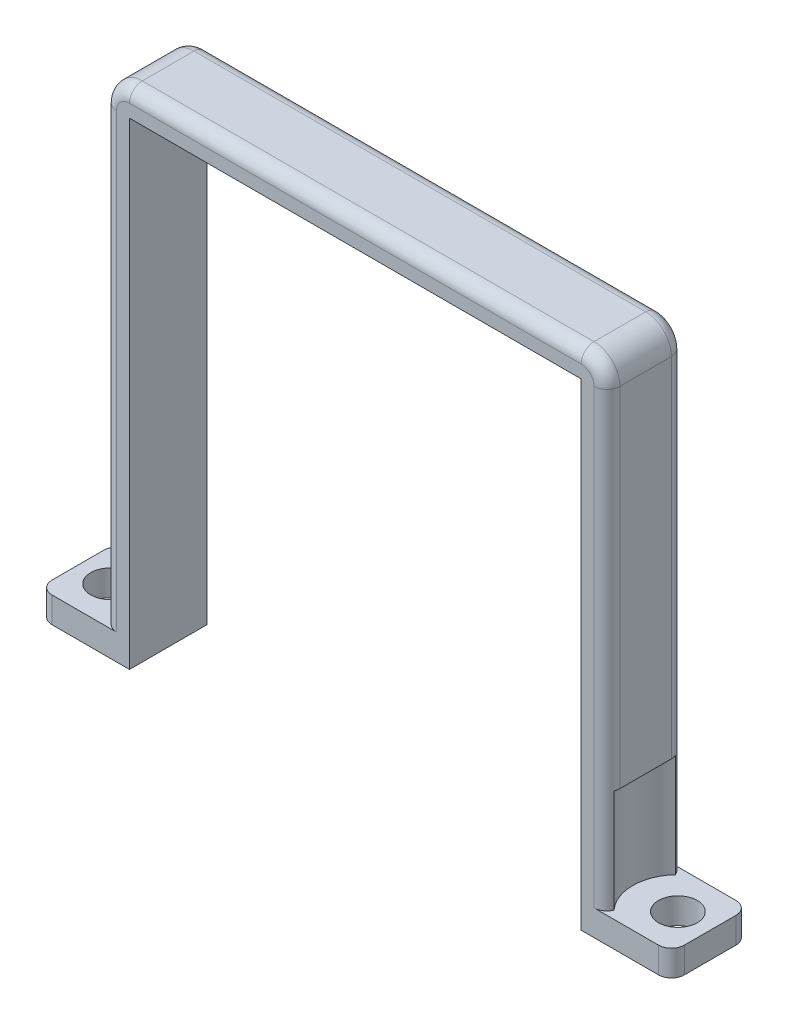
ISO-10303-21;
HEADER;
FILE_DESCRIPTION(('STEP AP214'),'2;1');
FILE_NAME('part.step','',(''),(''),'','','');
FILE_SCHEMA(('AUTOMOTIVE_DESIGN { 1 0 10303 214 1 1 1 1 }'));
ENDSEC;
DATA;
#1=APPLICATION_CONTEXT('core data for automotive mechanical design processes');
#2=APPLICATION_PROTOCOL_DEFINITION('international standard','automotive_design',2000,#1);
#3=PRODUCT_CONTEXT('',#1,'mechanical');
#4=PRODUCT('Part','Part','',(#3));
#5=PRODUCT_RELATED_PRODUCT_CATEGORY('part','',(#4));
#6=PRODUCT_DEFINITION_FORMATION('','',#4);
#7=PRODUCT_DEFINITION_CONTEXT('part definition',#1,'design');
#8=PRODUCT_DEFINITION('design','',#6,#7);
#9=PRODUCT_DEFINITION_SHAPE('','',#8);
#10=(LENGTH_UNIT() NAMED_UNIT(*) SI_UNIT(.MILLI.,.METRE.));
#11=(NAMED_UNIT(*) PLANE_ANGLE_UNIT() SI_UNIT($,.RADIAN.));
#12=(NAMED_UNIT(*) SI_UNIT($,.STERADIAN.) SOLID_ANGLE_UNIT());
#13=UNCERTAINTY_MEASURE_WITH_UNIT(LENGTH_MEASURE(1.E-05),#10,'distance_accuracy_value','');
#14=(GEOMETRIC_REPRESENTATION_CONTEXT(3) GLOBAL_UNCERTAINTY_ASSIGNED_CONTEXT((#13)) GLOBAL_UNIT_ASSIGNED_CONTEXT((#10,
#11,#12)) REPRESENTATION_CONTEXT('',''));
#15=CARTESIAN_POINT('',(0.,0.,0.));
#16=DIRECTION('',(0.,0.,1.));
#17=DIRECTION('',(1.,0.,0.));
#18=AXIS2_PLACEMENT_3D('',#15,#16,#17);
#19=CARTESIAN_POINT('',(19.5,0.,6.));
#20=DIRECTION('',(1.,0.,0.));
#21=DIRECTION('',(0.,1.,0.));
#22=AXIS2_PLACEMENT_3D('',#19,#20,#21);
#23=PLANE('',#22);
#24=DIRECTION('',(0.,0.,-1.));
#25=VECTOR('',#24,1.);
#26=CARTESIAN_POINT('',(19.5,10.,6.));
#27=LINE('',#26,#25);
#28=CARTESIAN_POINT('',(19.5,10.,5.));
#29=VERTEX_POINT('',#28);
#30=CARTESIAN_POINT('',(19.5,10.,1.));
#31=VERTEX_POINT('',#30);
#32=EDGE_CURVE('E350',#29,#31,#27,.T.);
#33=ORIENTED_EDGE('',*,*,#32,.T.);
#34=DIRECTION('',(0.,-1.,0.));
#35=VECTOR('',#34,1.);
#36=CARTESIAN_POINT('',(19.5,37.,1.));
#37=LINE('',#36,#35);
#38=CARTESIAN_POINT('',(19.5,37.,1.));
#39=VERTEX_POINT('',#38);
#40=EDGE_CURVE('E393',#31,#39,#37,.F.);
#41=ORIENTED_EDGE('',*,*,#40,.T.);
#42=DIRECTION('',(0.,0.,-1.));
#43=VECTOR('',#42,1.);
#44=CARTESIAN_POINT('',(19.5,37.,6.));
#45=LINE('',#44,#43);
#46=CARTESIAN_POINT('',(19.5,37.,5.));
#47=VERTEX_POINT('',#46);
#48=EDGE_CURVE('E342',#39,#47,#45,.F.);
#49=ORIENTED_EDGE('',*,*,#48,.T.);
#50=DIRECTION('',(0.,-1.,0.));
#51=VECTOR('',#50,1.);
#52=CARTESIAN_POINT('',(19.5,0.,5.));
#53=LINE('',#52,#51);
#54=EDGE_CURVE('E389',#47,#29,#53,.T.);
#55=ORIENTED_EDGE('',*,*,#54,.T.);
#56=EDGE_LOOP('',(#33,#41,#49,#55));
#57=FACE_BOUND('',#56,.T.);
#58=ADVANCED_FACE('F49',(#57),#23,.T.);
#59=CARTESIAN_POINT('',(-19.5,0.,6.));
#60=DIRECTION('',(1.,0.,0.));
#61=DIRECTION('',(0.,1.,0.));
#62=AXIS2_PLACEMENT_3D('',#59,#60,#61);
#63=PLANE('',#62);
#64=DIRECTION('',(0.,0.,-1.));
#65=VECTOR('',#64,1.);
#66=CARTESIAN_POINT('',(-19.5,37.,6.));
#67=LINE('',#66,#65);
#68=CARTESIAN_POINT('',(-19.5,37.,5.));
#69=VERTEX_POINT('',#68);
#70=CARTESIAN_POINT('',(-19.5,37.,1.));
#71=VERTEX_POINT('',#70);
#72=EDGE_CURVE('E330',#69,#71,#67,.T.);
#73=ORIENTED_EDGE('',*,*,#72,.T.);
#74=DIRECTION('',(0.,-1.,0.));
#75=VECTOR('',#74,1.);
#76=CARTESIAN_POINT('',(-19.5,0.,1.));
#77=LINE('',#76,#75);
#78=CARTESIAN_POINT('',(-19.5,10.,1.));
#79=VERTEX_POINT('',#78);
#80=EDGE_CURVE('E438',#71,#79,#77,.T.);
#81=ORIENTED_EDGE('',*,*,#80,.T.);
#82=DIRECTION('',(0.,0.,1.));
#83=VECTOR('',#82,1.);
#84=CARTESIAN_POINT('',(-19.5,10.,6.));
#85=LINE('',#84,#83);
#86=CARTESIAN_POINT('',(-19.5,10.,5.));
#87=VERTEX_POINT('',#86);
#88=EDGE_CURVE('E346',#79,#87,#85,.T.);
#89=ORIENTED_EDGE('',*,*,#88,.T.);
#90=DIRECTION('',(0.,-1.,0.));
#91=VECTOR('',#90,1.);
#92=CARTESIAN_POINT('',(-19.5,37.,5.));
#93=LINE('',#92,#91);
#94=EDGE_CURVE('E435',#87,#69,#93,.F.);
#95=ORIENTED_EDGE('',*,*,#94,.T.);
#96=EDGE_LOOP('',(#73,#81,#89,#95));
#97=FACE_BOUND('',#96,.T.);
#98=ADVANCED_FACE('F589',(#97),#63,.F.);
#99=CARTESIAN_POINT('',(0.,2.,6.));
#100=DIRECTION('',(0.,-1.,0.));
#101=DIRECTION('',(1.,0.,0.));
#102=AXIS2_PLACEMENT_3D('',#99,#100,#101);
#103=PLANE('',#102);
#104=DIRECTION('',(-1.,0.,0.));
#105=VECTOR('',#104,1.);
#106=CARTESIAN_POINT('',(0.,2.,0.));
#107=LINE('',#106,#105);
#108=CARTESIAN_POINT('',(-18.5,2.,0.));
#109=VERTEX_POINT('',#108);
#110=CARTESIAN_POINT('',(-23.5,2.,0.));
#111=VERTEX_POINT('',#110);
#112=EDGE_CURVE('E285',#109,#111,#107,.T.);
#113=ORIENTED_EDGE('',*,*,#112,.T.);
#114=CARTESIAN_POINT('',(-23.5,2.,1.));
#115=DIRECTION('',(0.,-1.,0.));
#116=DIRECTION('',(1.,0.,0.));
#117=AXIS2_PLACEMENT_3D('',#114,#115,#116);
#118=CIRCLE('',#117,1.);
#119=CARTESIAN_POINT('',(-24.5,2.,1.));
#120=VERTEX_POINT('',#119);
#121=EDGE_CURVE('E67',#111,#120,#118,.F.);
#122=ORIENTED_EDGE('',*,*,#121,.T.);
#123=DIRECTION('',(0.,0.,-1.));
#124=VECTOR('',#123,1.);
#125=CARTESIAN_POINT('',(-24.5,2.,6.));
#126=LINE('',#125,#124);
#127=CARTESIAN_POINT('',(-24.5,2.,5.));
#128=VERTEX_POINT('',#127);
#129=EDGE_CURVE('E327',#128,#120,#126,.T.);
#130=ORIENTED_EDGE('',*,*,#129,.F.);
#131=CARTESIAN_POINT('',(-23.5,2.,5.));
#132=DIRECTION('',(0.,-1.,0.));
#133=DIRECTION('',(1.,0.,0.));
#134=AXIS2_PLACEMENT_3D('',#131,#132,#133);
#135=CIRCLE('',#134,1.);
#136=CARTESIAN_POINT('',(-23.5,2.,6.));
#137=VERTEX_POINT('',#136);
#138=EDGE_CURVE('E484',#128,#137,#135,.F.);
#139=ORIENTED_EDGE('',*,*,#138,.T.);
#140=DIRECTION('',(-1.,0.,0.));
#141=VECTOR('',#140,1.);
#142=CARTESIAN_POINT('',(0.,2.,6.));
#143=LINE('',#142,#141);
#144=CARTESIAN_POINT('',(-18.5,2.,6.));
#145=VERTEX_POINT('',#144);
#146=EDGE_CURVE('E249',#145,#137,#143,.T.);
#147=ORIENTED_EDGE('',*,*,#146,.F.);
#148=CARTESIAN_POINT('',(-18.5,2.,5.));
#149=DIRECTION('',(0.,-1.,0.));
#150=DIRECTION('',(1.,0.,0.));
#151=AXIS2_PLACEMENT_3D('',#148,#149,#150);
#152=CIRCLE('',#151,1.);
#153=CARTESIAN_POINT('',(-19.42766494279,2.00000000000001,5.37341364988242));
#154=VERTEX_POINT('',#153);
#155=EDGE_CURVE('E11',#145,#154,#152,.T.);
#156=ORIENTED_EDGE('',*,*,#155,.T.);
#157=CARTESIAN_POINT('',(-22.,2.00000000000001,3.));
#158=DIRECTION('',(0.,1.,0.));
#159=DIRECTION('',(-1.,0.,0.));
#160=AXIS2_PLACEMENT_3D('',#157,#158,#159);
#161=CIRCLE('',#160,3.5);
#162=CARTESIAN_POINT('',(-19.4276649427899,2.00000000000001,0.626586350117578));
#163=VERTEX_POINT('',#162);
#164=EDGE_CURVE('E608',#154,#163,#161,.T.);
#165=ORIENTED_EDGE('',*,*,#164,.T.);
#166=CARTESIAN_POINT('',(-18.5,2.,1.));
#167=DIRECTION('',(0.,-1.,0.));
#168=DIRECTION('',(1.,0.,0.));
#169=AXIS2_PLACEMENT_3D('',#166,#167,#168);
#170=CIRCLE('',#169,1.);
#171=EDGE_CURVE('E59',#163,#109,#170,.T.);
#172=ORIENTED_EDGE('',*,*,#171,.T.);
#173=EDGE_LOOP('',(#113,#122,#130,#139,#147,#156,#165,#172));
#174=FACE_BOUND('',#173,.T.);
#175=CARTESIAN_POINT('',(-22.,2.00000000000001,3.));
#176=DIRECTION('',(0.,1.,0.));
#177=DIRECTION('',(-1.,0.,0.));
#178=AXIS2_PLACEMENT_3D('',#175,#176,#177);
#179=CIRCLE('',#178,1.5);
#180=CARTESIAN_POINT('',(-23.5,2.00000000000001,3.));
#181=VERTEX_POINT('',#180);
#182=EDGE_CURVE('E624',#181,#181,#179,.T.);
#183=ORIENTED_EDGE('',*,*,#182,.F.);
#184=EDGE_LOOP('',(#183));
#185=FACE_BOUND('',#184,.T.);
#186=ADVANCED_FACE('F658',(#174,#185),#103,.F.);
#187=CARTESIAN_POINT('',(-24.5,0.,6.));
#188=DIRECTION('',(1.,0.,0.));
#189=DIRECTION('',(0.,0.,-1.));
#190=AXIS2_PLACEMENT_3D('',#187,#188,#189);
#191=PLANE('',#190);
#192=ORIENTED_EDGE('',*,*,#129,.T.);
#193=DIRECTION('',(0.,-1.,0.));
#194=VECTOR('',#193,1.);
#195=CARTESIAN_POINT('',(-24.5,0.,1.));
#196=LINE('',#195,#194);
#197=CARTESIAN_POINT('',(-24.5,0.,1.));
#198=VERTEX_POINT('',#197);
#199=EDGE_CURVE('E474',#120,#198,#196,.T.);
#200=ORIENTED_EDGE('',*,*,#199,.T.);
#201=DIRECTION('',(0.,0.,-1.));
#202=VECTOR('',#201,1.);
#203=CARTESIAN_POINT('',(-24.5,0.,6.));
#204=LINE('',#203,#202);
#205=CARTESIAN_POINT('',(-24.5,0.,5.));
#206=VERTEX_POINT('',#205);
#207=EDGE_CURVE('E260',#206,#198,#204,.T.);
#208=ORIENTED_EDGE('',*,*,#207,.F.);
#209=DIRECTION('',(0.,-1.,0.));
#210=VECTOR('',#209,1.);
#211=CARTESIAN_POINT('',(-24.5,2.,5.));
#212=LINE('',#211,#210);
#213=EDGE_CURVE('E74',#206,#128,#212,.F.);
#214=ORIENTED_EDGE('',*,*,#213,.T.);
#215=EDGE_LOOP('',(#192,#200,#208,#214));
#216=FACE_BOUND('',#215,.T.);
#217=ADVANCED_FACE('F731',(#216),#191,.F.);
#218=CARTESIAN_POINT('',(0.,0.,6.));
#219=DIRECTION('',(0.,1.,0.));
#220=DIRECTION('',(-1.,0.,0.));
#221=AXIS2_PLACEMENT_3D('',#218,#219,#220);
#222=PLANE('',#221);
#223=CARTESIAN_POINT('',(-22.,0.,3.));
#224=DIRECTION('',(0.,-1.,0.));
#225=DIRECTION('',(1.,0.,0.));
#226=AXIS2_PLACEMENT_3D('',#223,#224,#225);
#227=CIRCLE('',#226,1.5);
#228=CARTESIAN_POINT('',(-20.5,0.,3.));
#229=VERTEX_POINT('',#228);
#230=EDGE_CURVE('E288',#229,#229,#227,.F.);
#231=ORIENTED_EDGE('',*,*,#230,.T.);
#232=EDGE_LOOP('',(#231));
#233=FACE_BOUND('',#232,.T.);
#234=ORIENTED_EDGE('',*,*,#207,.T.);
#235=CARTESIAN_POINT('',(-23.5,0.,1.));
#236=DIRECTION('',(0.,1.,0.));
#237=DIRECTION('',(-1.,0.,0.));
#238=AXIS2_PLACEMENT_3D('',#235,#236,#237);
#239=CIRCLE('',#238,1.);
#240=CARTESIAN_POINT('',(-23.5,0.,0.));
#241=VERTEX_POINT('',#240);
#242=EDGE_CURVE('E481',#198,#241,#239,.F.);
#243=ORIENTED_EDGE('',*,*,#242,.T.);
#244=DIRECTION('',(1.,0.,0.));
#245=VECTOR('',#244,1.);
#246=CARTESIAN_POINT('',(0.,0.,0.));
#247=LINE('',#246,#245);
#248=CARTESIAN_POINT('',(-17.5,0.,0.));
#249=VERTEX_POINT('',#248);
#250=EDGE_CURVE('E256',#241,#249,#247,.T.);
#251=ORIENTED_EDGE('',*,*,#250,.T.);
#252=DIRECTION('',(0.,0.,-1.));
#253=VECTOR('',#252,1.);
#254=CARTESIAN_POINT('',(-17.5,0.,6.));
#255=LINE('',#254,#253);
#256=CARTESIAN_POINT('',(-17.5,0.,6.));
#257=VERTEX_POINT('',#256);
#258=EDGE_CURVE('E252',#257,#249,#255,.T.);
#259=ORIENTED_EDGE('',*,*,#258,.F.);
#260=DIRECTION('',(1.,0.,0.));
#261=VECTOR('',#260,1.);
#262=CARTESIAN_POINT('',(0.,0.,6.));
#263=LINE('',#262,#261);
#264=CARTESIAN_POINT('',(-23.5,0.,6.));
#265=VERTEX_POINT('',#264);
#266=EDGE_CURVE('E238',#265,#257,#263,.T.);
#267=ORIENTED_EDGE('',*,*,#266,.F.);
#268=CARTESIAN_POINT('',(-23.5,0.,5.));
#269=DIRECTION('',(0.,1.,0.));
#270=DIRECTION('',(-1.,0.,0.));
#271=AXIS2_PLACEMENT_3D('',#268,#269,#270);
#272=CIRCLE('',#271,1.);
#273=EDGE_CURVE('E478',#265,#206,#272,.F.);
#274=ORIENTED_EDGE('',*,*,#273,.T.);
#275=EDGE_LOOP('',(#234,#243,#251,#259,#267,#274));
#276=FACE_BOUND('',#275,.T.);
#277=ADVANCED_FACE('F254',(#233,#276),#222,.F.);
#278=CARTESIAN_POINT('',(-17.5,0.,6.));
#279=DIRECTION('',(-1.,0.,0.));
#280=DIRECTION('',(0.,0.,1.));
#281=AXIS2_PLACEMENT_3D('',#278,#279,#280);
#282=PLANE('',#281);
#283=DIRECTION('',(0.,1.,0.));
#284=VECTOR('',#283,1.);
#285=CARTESIAN_POINT('',(-17.5,0.,0.));
#286=LINE('',#285,#284);
#287=CARTESIAN_POINT('',(-17.5,37.,0.));
#288=VERTEX_POINT('',#287);
#289=EDGE_CURVE('E291',#249,#288,#286,.T.);
#290=ORIENTED_EDGE('',*,*,#289,.T.);
#291=DIRECTION('',(0.,0.,-1.));
#292=VECTOR('',#291,1.);
#293=CARTESIAN_POINT('',(-17.5,37.,6.));
#294=LINE('',#293,#292);
#295=CARTESIAN_POINT('',(-17.5,37.,6.));
#296=VERTEX_POINT('',#295);
#297=EDGE_CURVE('E261',#296,#288,#294,.T.);
#298=ORIENTED_EDGE('',*,*,#297,.F.);
#299=DIRECTION('',(0.,1.,0.));
#300=VECTOR('',#299,1.);
#301=CARTESIAN_POINT('',(-17.5,0.,6.));
#302=LINE('',#301,#300);
#303=EDGE_CURVE('E242',#257,#296,#302,.T.);
#304=ORIENTED_EDGE('',*,*,#303,.F.);
#305=ORIENTED_EDGE('',*,*,#258,.T.);
#306=EDGE_LOOP('',(#290,#298,#304,#305));
#307=FACE_BOUND('',#306,.T.);
#308=ADVANCED_FACE('F263',(#307),#282,.F.);
#309=CARTESIAN_POINT('',(0.,37.,6.));
#310=DIRECTION('',(0.,1.,0.));
#311=DIRECTION('',(0.,0.,1.));
#312=AXIS2_PLACEMENT_3D('',#309,#310,#311);
#313=PLANE('',#312);
#314=DIRECTION('',(1.,0.,0.));
#315=VECTOR('',#314,1.);
#316=CARTESIAN_POINT('',(0.,37.,0.));
#317=LINE('',#316,#315);
#318=CARTESIAN_POINT('',(17.5,37.,0.));
#319=VERTEX_POINT('',#318);
#320=EDGE_CURVE('E294',#288,#319,#317,.T.);
#321=ORIENTED_EDGE('',*,*,#320,.T.);
#322=DIRECTION('',(0.,0.,-1.));
#323=VECTOR('',#322,1.);
#324=CARTESIAN_POINT('',(17.5,37.,6.));
#325=LINE('',#324,#323);
#326=CARTESIAN_POINT('',(17.5,37.,6.));
#327=VERTEX_POINT('',#326);
#328=EDGE_CURVE('E320',#327,#319,#325,.T.);
#329=ORIENTED_EDGE('',*,*,#328,.F.);
#330=DIRECTION('',(1.,0.,0.));
#331=VECTOR('',#330,1.);
#332=CARTESIAN_POINT('',(0.,37.,6.));
#333=LINE('',#332,#331);
#334=EDGE_CURVE('E267',#296,#327,#333,.T.);
#335=ORIENTED_EDGE('',*,*,#334,.F.);
#336=ORIENTED_EDGE('',*,*,#297,.T.);
#337=EDGE_LOOP('',(#321,#329,#335,#336));
#338=FACE_BOUND('',#337,.T.);
#339=ADVANCED_FACE('F736',(#338),#313,.F.);
#340=CARTESIAN_POINT('',(17.5,0.,6.));
#341=DIRECTION('',(-1.,0.,0.));
#342=DIRECTION('',(0.,0.,1.));
#343=AXIS2_PLACEMENT_3D('',#340,#341,#342);
#344=PLANE('',#343);
#345=DIRECTION('',(0.,1.,0.));
#346=VECTOR('',#345,1.);
#347=CARTESIAN_POINT('',(17.5,0.,0.));
#348=LINE('',#347,#346);
#349=CARTESIAN_POINT('',(17.5,0.,0.));
#350=VERTEX_POINT('',#349);
#351=EDGE_CURVE('E298',#350,#319,#348,.T.);
#352=ORIENTED_EDGE('',*,*,#351,.F.);
#353=DIRECTION('',(0.,0.,-1.));
#354=VECTOR('',#353,1.);
#355=CARTESIAN_POINT('',(17.5,0.,6.));
#356=LINE('',#355,#354);
#357=CARTESIAN_POINT('',(17.5,0.,6.));
#358=VERTEX_POINT('',#357);
#359=EDGE_CURVE('E316',#358,#350,#356,.T.);
#360=ORIENTED_EDGE('',*,*,#359,.F.);
#361=DIRECTION('',(0.,1.,0.));
#362=VECTOR('',#361,1.);
#363=CARTESIAN_POINT('',(17.5,0.,6.));
#364=LINE('',#363,#362);
#365=EDGE_CURVE('E270',#358,#327,#364,.T.);
#366=ORIENTED_EDGE('',*,*,#365,.T.);
#367=ORIENTED_EDGE('',*,*,#328,.T.);
#368=EDGE_LOOP('',(#352,#360,#366,#367));
#369=FACE_BOUND('',#368,.T.);
#370=ADVANCED_FACE('F744',(#369),#344,.T.);
#371=CARTESIAN_POINT('',(0.,0.,6.));
#372=DIRECTION('',(0.,-1.,0.));
#373=DIRECTION('',(1.,0.,0.));
#374=AXIS2_PLACEMENT_3D('',#371,#372,#373);
#375=PLANE('',#374);
#376=CARTESIAN_POINT('',(22.,0.,2.99999999999999));
#377=DIRECTION('',(0.,-1.,0.));
#378=DIRECTION('',(1.,0.,0.));
#379=AXIS2_PLACEMENT_3D('',#376,#377,#378);
#380=CIRCLE('',#379,1.5);
#381=CARTESIAN_POINT('',(23.5,0.,2.99999999999999));
#382=VERTEX_POINT('',#381);
#383=EDGE_CURVE('E607',#382,#382,#380,.F.);
#384=ORIENTED_EDGE('',*,*,#383,.T.);
#385=EDGE_LOOP('',(#384));
#386=FACE_BOUND('',#385,.T.);
#387=DIRECTION('',(-1.,0.,0.));
#388=VECTOR('',#387,1.);
#389=CARTESIAN_POINT('',(0.,0.,0.));
#390=LINE('',#389,#388);
#391=CARTESIAN_POINT('',(23.5,0.,0.));
#392=VERTEX_POINT('',#391);
#393=EDGE_CURVE('E302',#392,#350,#390,.T.);
#394=ORIENTED_EDGE('',*,*,#393,.F.);
#395=CARTESIAN_POINT('',(23.5,0.,1.));
#396=DIRECTION('',(0.,-1.,0.));
#397=DIRECTION('',(1.,0.,0.));
#398=AXIS2_PLACEMENT_3D('',#395,#396,#397);
#399=CIRCLE('',#398,1.);
#400=CARTESIAN_POINT('',(24.5,0.,1.));
#401=VERTEX_POINT('',#400);
#402=EDGE_CURVE('E456',#392,#401,#399,.T.);
#403=ORIENTED_EDGE('',*,*,#402,.T.);
#404=DIRECTION('',(0.,0.,-1.));
#405=VECTOR('',#404,1.);
#406=CARTESIAN_POINT('',(24.5,0.,6.));
#407=LINE('',#406,#405);
#408=CARTESIAN_POINT('',(24.5,0.,5.));
#409=VERTEX_POINT('',#408);
#410=EDGE_CURVE('E312',#409,#401,#407,.T.);
#411=ORIENTED_EDGE('',*,*,#410,.F.);
#412=CARTESIAN_POINT('',(23.5,0.,5.));
#413=DIRECTION('',(0.,-1.,0.));
#414=DIRECTION('',(1.,0.,0.));
#415=AXIS2_PLACEMENT_3D('',#412,#413,#414);
#416=CIRCLE('',#415,1.);
#417=CARTESIAN_POINT('',(23.5,0.,6.));
#418=VERTEX_POINT('',#417);
#419=EDGE_CURVE('E453',#409,#418,#416,.T.);
#420=ORIENTED_EDGE('',*,*,#419,.T.);
#421=DIRECTION('',(-1.,0.,0.));
#422=VECTOR('',#421,1.);
#423=CARTESIAN_POINT('',(0.,0.,6.));
#424=LINE('',#423,#422);
#425=EDGE_CURVE('E277',#418,#358,#424,.T.);
#426=ORIENTED_EDGE('',*,*,#425,.T.);
#427=ORIENTED_EDGE('',*,*,#359,.T.);
#428=EDGE_LOOP('',(#394,#403,#411,#420,#426,#427));
#429=FACE_BOUND('',#428,.T.);
#430=ADVANCED_FACE('F649',(#386,#429),#375,.T.);
#431=CARTESIAN_POINT('',(24.5,0.,6.));
#432=DIRECTION('',(1.,0.,0.));
#433=DIRECTION('',(0.,0.,-1.));
#434=AXIS2_PLACEMENT_3D('',#431,#432,#433);
#435=PLANE('',#434);
#436=ORIENTED_EDGE('',*,*,#410,.T.);
#437=DIRECTION('',(0.,-1.,0.));
#438=VECTOR('',#437,1.);
#439=CARTESIAN_POINT('',(24.5,2.,1.));
#440=LINE('',#439,#438);
#441=CARTESIAN_POINT('',(24.5,2.,1.));
#442=VERTEX_POINT('',#441);
#443=EDGE_CURVE('E463',#401,#442,#440,.F.);
#444=ORIENTED_EDGE('',*,*,#443,.T.);
#445=DIRECTION('',(0.,0.,-1.));
#446=VECTOR('',#445,1.);
#447=CARTESIAN_POINT('',(24.5,2.,6.));
#448=LINE('',#447,#446);
#449=CARTESIAN_POINT('',(24.5,2.,5.));
#450=VERTEX_POINT('',#449);
#451=EDGE_CURVE('E284',#450,#442,#448,.T.);
#452=ORIENTED_EDGE('',*,*,#451,.F.);
#453=DIRECTION('',(0.,-1.,0.));
#454=VECTOR('',#453,1.);
#455=CARTESIAN_POINT('',(24.5,0.,5.));
#456=LINE('',#455,#454);
#457=EDGE_CURVE('E459',#450,#409,#456,.T.);
#458=ORIENTED_EDGE('',*,*,#457,.T.);
#459=EDGE_LOOP('',(#436,#444,#452,#458));
#460=FACE_BOUND('',#459,.T.);
#461=ADVANCED_FACE('F641',(#460),#435,.T.);
#462=CARTESIAN_POINT('',(0.,2.,6.));
#463=DIRECTION('',(0.,1.,0.));
#464=DIRECTION('',(-1.,0.,0.));
#465=AXIS2_PLACEMENT_3D('',#462,#463,#464);
#466=PLANE('',#465);
#467=ORIENTED_EDGE('',*,*,#451,.T.);
#468=CARTESIAN_POINT('',(23.5,2.,1.));
#469=DIRECTION('',(0.,1.,0.));
#470=DIRECTION('',(-1.,0.,0.));
#471=AXIS2_PLACEMENT_3D('',#468,#469,#470);
#472=CIRCLE('',#471,1.);
#473=CARTESIAN_POINT('',(23.5,2.,0.));
#474=VERTEX_POINT('',#473);
#475=EDGE_CURVE('E469',#442,#474,#472,.T.);
#476=ORIENTED_EDGE('',*,*,#475,.T.);
#477=DIRECTION('',(1.,0.,0.));
#478=VECTOR('',#477,1.);
#479=CARTESIAN_POINT('',(0.,2.,0.));
#480=LINE('',#479,#478);
#481=CARTESIAN_POINT('',(18.5,2.,0.));
#482=VERTEX_POINT('',#481);
#483=EDGE_CURVE('E305',#482,#474,#480,.T.);
#484=ORIENTED_EDGE('',*,*,#483,.F.);
#485=CARTESIAN_POINT('',(18.5,2.,1.));
#486=DIRECTION('',(0.,1.,0.));
#487=DIRECTION('',(-1.,0.,0.));
#488=AXIS2_PLACEMENT_3D('',#485,#486,#487);
#489=CIRCLE('',#488,1.);
#490=CARTESIAN_POINT('',(19.4276649427899,2.,0.626586350117569));
#491=VERTEX_POINT('',#490);
#492=EDGE_CURVE('E489',#482,#491,#489,.F.);
#493=ORIENTED_EDGE('',*,*,#492,.T.);
#494=CARTESIAN_POINT('',(22.,2.,2.99999999999999));
#495=DIRECTION('',(0.,1.,0.));
#496=DIRECTION('',(1.,0.,0.));
#497=AXIS2_PLACEMENT_3D('',#494,#495,#496);
#498=CIRCLE('',#497,3.5);
#499=CARTESIAN_POINT('',(19.42766494279,2.,5.37341364988242));
#500=VERTEX_POINT('',#499);
#501=EDGE_CURVE('E615',#491,#500,#498,.T.);
#502=ORIENTED_EDGE('',*,*,#501,.T.);
#503=CARTESIAN_POINT('',(18.5,2.,5.));
#504=DIRECTION('',(0.,1.,0.));
#505=DIRECTION('',(-1.,0.,0.));
#506=AXIS2_PLACEMENT_3D('',#503,#504,#505);
#507=CIRCLE('',#506,1.);
#508=CARTESIAN_POINT('',(18.5,2.,6.));
#509=VERTEX_POINT('',#508);
#510=EDGE_CURVE('E492',#500,#509,#507,.F.);
#511=ORIENTED_EDGE('',*,*,#510,.T.);
#512=DIRECTION('',(1.,0.,0.));
#513=VECTOR('',#512,1.);
#514=CARTESIAN_POINT('',(0.,2.,6.));
#515=LINE('',#514,#513);
#516=CARTESIAN_POINT('',(23.5,2.,6.));
#517=VERTEX_POINT('',#516);
#518=EDGE_CURVE('E280',#509,#517,#515,.T.);
#519=ORIENTED_EDGE('',*,*,#518,.T.);
#520=CARTESIAN_POINT('',(23.5,2.,5.));
#521=DIRECTION('',(0.,1.,0.));
#522=DIRECTION('',(-1.,0.,0.));
#523=AXIS2_PLACEMENT_3D('',#520,#521,#522);
#524=CIRCLE('',#523,1.);
#525=EDGE_CURVE('E466',#517,#450,#524,.T.);
#526=ORIENTED_EDGE('',*,*,#525,.T.);
#527=EDGE_LOOP('',(#467,#476,#484,#493,#502,#511,#519,#526));
#528=FACE_BOUND('',#527,.T.);
#529=CARTESIAN_POINT('',(22.,2.,2.99999999999999));
#530=DIRECTION('',(0.,1.,0.));
#531=DIRECTION('',(1.,0.,0.));
#532=AXIS2_PLACEMENT_3D('',#529,#530,#531);
#533=CIRCLE('',#532,1.5);
#534=CARTESIAN_POINT('',(23.5,2.,2.99999999999999));
#535=VERTEX_POINT('',#534);
#536=EDGE_CURVE('E613',#535,#535,#533,.T.);
#537=ORIENTED_EDGE('',*,*,#536,.F.);
#538=EDGE_LOOP('',(#537));
#539=FACE_BOUND('',#538,.T.);
#540=ADVANCED_FACE('F639',(#528,#539),#466,.T.);
#541=CARTESIAN_POINT('',(0.,39.,6.));
#542=DIRECTION('',(0.,-1.,0.));
#543=DIRECTION('',(0.,0.,-1.));
#544=AXIS2_PLACEMENT_3D('',#541,#542,#543);
#545=PLANE('',#544);
#546=DIRECTION('',(0.,0.,-1.));
#547=VECTOR('',#546,1.);
#548=CARTESIAN_POINT('',(17.5,39.,0.));
#549=LINE('',#548,#547);
#550=CARTESIAN_POINT('',(17.5,39.,5.));
#551=VERTEX_POINT('',#550);
#552=CARTESIAN_POINT('',(17.5,39.,1.));
#553=VERTEX_POINT('',#552);
#554=EDGE_CURVE('E334',#551,#553,#549,.T.);
#555=ORIENTED_EDGE('',*,*,#554,.T.);
#556=DIRECTION('',(-1.,0.,0.));
#557=VECTOR('',#556,1.);
#558=CARTESIAN_POINT('',(0.,39.,1.));
#559=LINE('',#558,#557);
#560=CARTESIAN_POINT('',(-17.5,39.,1.));
#561=VERTEX_POINT('',#560);
#562=EDGE_CURVE('E405',#553,#561,#559,.T.);
#563=ORIENTED_EDGE('',*,*,#562,.T.);
#564=DIRECTION('',(0.,0.,-1.));
#565=VECTOR('',#564,1.);
#566=CARTESIAN_POINT('',(-17.5,39.,6.));
#567=LINE('',#566,#565);
#568=CARTESIAN_POINT('',(-17.5,39.,5.));
#569=VERTEX_POINT('',#568);
#570=EDGE_CURVE('E338',#561,#569,#567,.F.);
#571=ORIENTED_EDGE('',*,*,#570,.T.);
#572=DIRECTION('',(-1.,0.,0.));
#573=VECTOR('',#572,1.);
#574=CARTESIAN_POINT('',(17.5,39.,5.));
#575=LINE('',#574,#573);
#576=EDGE_CURVE('E402',#569,#551,#575,.F.);
#577=ORIENTED_EDGE('',*,*,#576,.T.);
#578=EDGE_LOOP('',(#555,#563,#571,#577));
#579=FACE_BOUND('',#578,.T.);
#580=ADVANCED_FACE('F573',(#579),#545,.F.);
#581=CARTESIAN_POINT('',(0.,0.,6.));
#582=DIRECTION('',(0.,0.,1.));
#583=DIRECTION('',(1.,0.,0.));
#584=AXIS2_PLACEMENT_3D('',#581,#582,#583);
#585=PLANE('',#584);
#586=ORIENTED_EDGE('',*,*,#518,.F.);
#587=DIRECTION('',(0.,-1.,0.));
#588=VECTOR('',#587,1.);
#589=CARTESIAN_POINT('',(18.5,0.,6.));
#590=LINE('',#589,#588);
#591=CARTESIAN_POINT('',(18.5,37.,6.));
#592=VERTEX_POINT('',#591);
#593=EDGE_CURVE('E432',#509,#592,#590,.F.);
#594=ORIENTED_EDGE('',*,*,#593,.T.);
#595=CARTESIAN_POINT('',(17.5,37.,6.));
#596=DIRECTION('',(0.,0.,1.));
#597=DIRECTION('',(1.,0.,0.));
#598=AXIS2_PLACEMENT_3D('',#595,#596,#597);
#599=CIRCLE('',#598,1.);
#600=CARTESIAN_POINT('',(17.5,38.,6.));
#601=VERTEX_POINT('',#600);
#602=EDGE_CURVE('E429',#592,#601,#599,.T.);
#603=ORIENTED_EDGE('',*,*,#602,.T.);
#604=DIRECTION('',(-1.,0.,0.));
#605=VECTOR('',#604,1.);
#606=CARTESIAN_POINT('',(-17.5,38.,6.));
#607=LINE('',#606,#605);
#608=CARTESIAN_POINT('',(-17.5,38.,6.));
#609=VERTEX_POINT('',#608);
#610=EDGE_CURVE('E426',#601,#609,#607,.T.);
#611=ORIENTED_EDGE('',*,*,#610,.T.);
#612=CARTESIAN_POINT('',(-17.5,37.,6.));
#613=DIRECTION('',(0.,0.,1.));
#614=DIRECTION('',(1.,0.,0.));
#615=AXIS2_PLACEMENT_3D('',#612,#613,#614);
#616=CIRCLE('',#615,1.);
#617=CARTESIAN_POINT('',(-18.5,37.,6.));
#618=VERTEX_POINT('',#617);
#619=EDGE_CURVE('E423',#609,#618,#616,.T.);
#620=ORIENTED_EDGE('',*,*,#619,.T.);
#621=DIRECTION('',(0.,-1.,0.));
#622=VECTOR('',#621,1.);
#623=CARTESIAN_POINT('',(-18.5,2.,6.));
#624=LINE('',#623,#622);
#625=EDGE_CURVE('E419',#618,#145,#624,.T.);
#626=ORIENTED_EDGE('',*,*,#625,.T.);
#627=ORIENTED_EDGE('',*,*,#146,.T.);
#628=DIRECTION('',(0.,-1.,0.));
#629=VECTOR('',#628,1.);
#630=CARTESIAN_POINT('',(-23.5,0.,6.));
#631=LINE('',#630,#629);
#632=EDGE_CURVE('E246',#137,#265,#631,.T.);
#633=ORIENTED_EDGE('',*,*,#632,.T.);
#634=ORIENTED_EDGE('',*,*,#266,.T.);
#635=ORIENTED_EDGE('',*,*,#303,.T.);
#636=ORIENTED_EDGE('',*,*,#334,.T.);
#637=ORIENTED_EDGE('',*,*,#365,.F.);
#638=ORIENTED_EDGE('',*,*,#425,.F.);
#639=DIRECTION('',(0.,-1.,0.));
#640=VECTOR('',#639,1.);
#641=CARTESIAN_POINT('',(23.5,0.,6.));
#642=LINE('',#641,#640);
#643=EDGE_CURVE('E416',#418,#517,#642,.F.);
#644=ORIENTED_EDGE('',*,*,#643,.T.);
#645=EDGE_LOOP('',(#586,#594,#603,#611,#620,#626,#627,#633,#634,#635,#636,#637,#638,#644));
#646=FACE_BOUND('',#645,.T.);
#647=ADVANCED_FACE('F240',(#646),#585,.T.);
#648=CARTESIAN_POINT('',(0.,0.,0.));
#649=DIRECTION('',(0.,0.,1.));
#650=DIRECTION('',(1.,0.,0.));
#651=AXIS2_PLACEMENT_3D('',#648,#649,#650);
#652=PLANE('',#651);
#653=DIRECTION('',(0.,-1.,0.));
#654=VECTOR('',#653,1.);
#655=CARTESIAN_POINT('',(18.5,2.,0.));
#656=LINE('',#655,#654);
#657=CARTESIAN_POINT('',(18.5,37.,0.));
#658=VERTEX_POINT('',#657);
#659=EDGE_CURVE('E373',#658,#482,#656,.T.);
#660=ORIENTED_EDGE('',*,*,#659,.T.);
#661=ORIENTED_EDGE('',*,*,#483,.T.);
#662=DIRECTION('',(0.,-1.,0.));
#663=VECTOR('',#662,1.);
#664=CARTESIAN_POINT('',(23.5,0.,0.));
#665=LINE('',#664,#663);
#666=EDGE_CURVE('E357',#474,#392,#665,.T.);
#667=ORIENTED_EDGE('',*,*,#666,.T.);
#668=ORIENTED_EDGE('',*,*,#393,.T.);
#669=ORIENTED_EDGE('',*,*,#351,.T.);
#670=ORIENTED_EDGE('',*,*,#320,.F.);
#671=ORIENTED_EDGE('',*,*,#289,.F.);
#672=ORIENTED_EDGE('',*,*,#250,.F.);
#673=DIRECTION('',(0.,-1.,0.));
#674=VECTOR('',#673,1.);
#675=CARTESIAN_POINT('',(-23.5,0.,0.));
#676=LINE('',#675,#674);
#677=EDGE_CURVE('E354',#241,#111,#676,.F.);
#678=ORIENTED_EDGE('',*,*,#677,.T.);
#679=ORIENTED_EDGE('',*,*,#112,.F.);
#680=DIRECTION('',(0.,-1.,0.));
#681=VECTOR('',#680,1.);
#682=CARTESIAN_POINT('',(-18.5,0.,0.));
#683=LINE('',#682,#681);
#684=CARTESIAN_POINT('',(-18.5,37.,0.));
#685=VERTEX_POINT('',#684);
#686=EDGE_CURVE('E361',#109,#685,#683,.F.);
#687=ORIENTED_EDGE('',*,*,#686,.T.);
#688=CARTESIAN_POINT('',(-17.5,37.,0.));
#689=DIRECTION('',(0.,0.,1.));
#690=DIRECTION('',(1.,0.,0.));
#691=AXIS2_PLACEMENT_3D('',#688,#689,#690);
#692=CIRCLE('',#691,1.);
#693=CARTESIAN_POINT('',(-17.5,38.,0.));
#694=VERTEX_POINT('',#693);
#695=EDGE_CURVE('E364',#685,#694,#692,.F.);
#696=ORIENTED_EDGE('',*,*,#695,.T.);
#697=DIRECTION('',(-1.,0.,0.));
#698=VECTOR('',#697,1.);
#699=CARTESIAN_POINT('',(0.,38.,0.));
#700=LINE('',#699,#698);
#701=CARTESIAN_POINT('',(17.5,38.,0.));
#702=VERTEX_POINT('',#701);
#703=EDGE_CURVE('E367',#694,#702,#700,.F.);
#704=ORIENTED_EDGE('',*,*,#703,.T.);
#705=CARTESIAN_POINT('',(17.5,37.,0.));
#706=DIRECTION('',(0.,0.,1.));
#707=DIRECTION('',(1.,0.,0.));
#708=AXIS2_PLACEMENT_3D('',#705,#706,#707);
#709=CIRCLE('',#708,1.);
#710=EDGE_CURVE('E370',#702,#658,#709,.F.);
#711=ORIENTED_EDGE('',*,*,#710,.T.);
#712=EDGE_LOOP('',(#660,#661,#667,#668,#669,#670,#671,#672,#678,#679,#687,#696,#704,#711));
#713=FACE_BOUND('',#712,.T.);
#714=ADVANCED_FACE('F661',(#713),#652,.F.);
#715=CARTESIAN_POINT('',(22.,-4.2426406871193,2.99999999999999));
#716=DIRECTION('',(0.,1.,0.));
#717=DIRECTION('',(-1.,0.,0.));
#718=AXIS2_PLACEMENT_3D('',#715,#716,#717);
#719=CYLINDRICAL_SURFACE('',#718,1.5);
#720=ORIENTED_EDGE('',*,*,#536,.T.);
#721=EDGE_LOOP('',(#720));
#722=FACE_BOUND('',#721,.T.);
#723=ORIENTED_EDGE('',*,*,#383,.F.);
#724=EDGE_LOOP('',(#723));
#725=FACE_BOUND('',#724,.T.);
#726=ADVANCED_FACE('F636',(#722,#725),#719,.F.);
#727=CARTESIAN_POINT('',(-22.,-4.24264068711929,3.));
#728=DIRECTION('',(0.,1.,0.));
#729=DIRECTION('',(-1.,0.,0.));
#730=AXIS2_PLACEMENT_3D('',#727,#728,#729);
#731=CYLINDRICAL_SURFACE('',#730,1.5);
#732=ORIENTED_EDGE('',*,*,#182,.T.);
#733=EDGE_LOOP('',(#732));
#734=FACE_BOUND('',#733,.T.);
#735=ORIENTED_EDGE('',*,*,#230,.F.);
#736=EDGE_LOOP('',(#735));
#737=FACE_BOUND('',#736,.T.);
#738=ADVANCED_FACE('F669',(#734,#737),#731,.F.);
#739=CARTESIAN_POINT('',(-17.5,37.,6.));
#740=DIRECTION('',(0.,0.,-1.));
#741=DIRECTION('',(-1.,0.,0.));
#742=AXIS2_PLACEMENT_3D('',#739,#740,#741);
#743=CYLINDRICAL_SURFACE('',#742,2.);
#744=ORIENTED_EDGE('',*,*,#570,.F.);
#745=CARTESIAN_POINT('',(-17.5,37.,1.));
#746=DIRECTION('',(0.,0.,1.));
#747=DIRECTION('',(1.,0.,0.));
#748=AXIS2_PLACEMENT_3D('',#745,#746,#747);
#749=CIRCLE('',#748,2.);
#750=EDGE_CURVE('E411',#561,#71,#749,.T.);
#751=ORIENTED_EDGE('',*,*,#750,.T.);
#752=ORIENTED_EDGE('',*,*,#72,.F.);
#753=CARTESIAN_POINT('',(-17.5,37.,5.));
#754=DIRECTION('',(0.,0.,1.));
#755=DIRECTION('',(1.,0.,0.));
#756=AXIS2_PLACEMENT_3D('',#753,#754,#755);
#757=CIRCLE('',#756,2.);
#758=EDGE_CURVE('E408',#69,#569,#757,.F.);
#759=ORIENTED_EDGE('',*,*,#758,.T.);
#760=EDGE_LOOP('',(#744,#751,#752,#759));
#761=FACE_BOUND('',#760,.T.);
#762=ADVANCED_FACE('F586',(#761),#743,.T.);
#763=CARTESIAN_POINT('',(17.5,37.,6.));
#764=DIRECTION('',(0.,0.,1.));
#765=DIRECTION('',(1.,0.,0.));
#766=AXIS2_PLACEMENT_3D('',#763,#764,#765);
#767=CYLINDRICAL_SURFACE('',#766,2.);
#768=ORIENTED_EDGE('',*,*,#48,.F.);
#769=CARTESIAN_POINT('',(17.5,37.,1.));
#770=DIRECTION('',(0.,0.,1.));
#771=DIRECTION('',(1.,0.,0.));
#772=AXIS2_PLACEMENT_3D('',#769,#770,#771);
#773=CIRCLE('',#772,2.);
#774=EDGE_CURVE('E399',#39,#553,#773,.T.);
#775=ORIENTED_EDGE('',*,*,#774,.T.);
#776=ORIENTED_EDGE('',*,*,#554,.F.);
#777=CARTESIAN_POINT('',(17.5,37.,5.));
#778=DIRECTION('',(0.,0.,1.));
#779=DIRECTION('',(1.,0.,0.));
#780=AXIS2_PLACEMENT_3D('',#777,#778,#779);
#781=CIRCLE('',#780,2.);
#782=EDGE_CURVE('E396',#551,#47,#781,.F.);
#783=ORIENTED_EDGE('',*,*,#782,.T.);
#784=EDGE_LOOP('',(#768,#775,#776,#783));
#785=FACE_BOUND('',#784,.T.);
#786=ADVANCED_FACE('F555',(#785),#767,.T.);
#787=CARTESIAN_POINT('',(-22.,10.,3.));
#788=DIRECTION('',(0.,1.,0.));
#789=DIRECTION('',(-1.,0.,0.));
#790=AXIS2_PLACEMENT_3D('',#787,#788,#789);
#791=PLANE('',#790);
#792=ORIENTED_EDGE('',*,*,#88,.F.);
#793=CARTESIAN_POINT('',(-18.5,10.,1.));
#794=DIRECTION('',(0.,1.,0.));
#795=DIRECTION('',(-1.,0.,0.));
#796=AXIS2_PLACEMENT_3D('',#793,#794,#795);
#797=CIRCLE('',#796,1.);
#798=CARTESIAN_POINT('',(-19.4276649427899,10.,0.626586350117578));
#799=VERTEX_POINT('',#798);
#800=EDGE_CURVE('E444',#79,#799,#797,.F.);
#801=ORIENTED_EDGE('',*,*,#800,.T.);
#802=CARTESIAN_POINT('',(-22.,10.,3.));
#803=DIRECTION('',(0.,1.,0.));
#804=DIRECTION('',(-1.,0.,0.));
#805=AXIS2_PLACEMENT_3D('',#802,#803,#804);
#806=CIRCLE('',#805,3.5);
#807=CARTESIAN_POINT('',(-19.42766494279,10.,5.37341364988242));
#808=VERTEX_POINT('',#807);
#809=EDGE_CURVE('E601',#808,#799,#806,.T.);
#810=ORIENTED_EDGE('',*,*,#809,.F.);
#811=CARTESIAN_POINT('',(-18.5,10.,5.));
#812=DIRECTION('',(0.,1.,0.));
#813=DIRECTION('',(-1.,0.,0.));
#814=AXIS2_PLACEMENT_3D('',#811,#812,#813);
#815=CIRCLE('',#814,1.);
#816=EDGE_CURVE('E441',#808,#87,#815,.F.);
#817=ORIENTED_EDGE('',*,*,#816,.T.);
#818=EDGE_LOOP('',(#792,#801,#810,#817));
#819=FACE_BOUND('',#818,.T.);
#820=ADVANCED_FACE('F600',(#819),#791,.F.);
#821=CARTESIAN_POINT('',(-22.,10.,3.));
#822=DIRECTION('',(0.,-1.,0.));
#823=DIRECTION('',(1.,0.,0.));
#824=AXIS2_PLACEMENT_3D('',#821,#822,#823);
#825=CYLINDRICAL_SURFACE('',#824,3.5);
#826=ORIENTED_EDGE('',*,*,#809,.T.);
#827=DIRECTION('',(0.,-1.,0.));
#828=VECTOR('',#827,1.);
#829=CARTESIAN_POINT('',(-19.4276649427899,10.,0.626586350117577));
#830=LINE('',#829,#828);
#831=EDGE_CURVE('E450',#799,#163,#830,.T.);
#832=ORIENTED_EDGE('',*,*,#831,.T.);
#833=ORIENTED_EDGE('',*,*,#164,.F.);
#834=DIRECTION('',(0.,1.,0.));
#835=VECTOR('',#834,1.);
#836=CARTESIAN_POINT('',(-19.42766494279,2.00000000000001,5.37341364988242));
#837=LINE('',#836,#835);
#838=EDGE_CURVE('E447',#154,#808,#837,.T.);
#839=ORIENTED_EDGE('',*,*,#838,.T.);
#840=EDGE_LOOP('',(#826,#832,#833,#839));
#841=FACE_BOUND('',#840,.T.);
#842=ADVANCED_FACE('F603',(#841),#825,.F.);
#843=CARTESIAN_POINT('',(22.,10.,2.99999999999999));
#844=DIRECTION('',(0.,-1.,0.));
#845=DIRECTION('',(1.,0.,0.));
#846=AXIS2_PLACEMENT_3D('',#843,#844,#845);
#847=CYLINDRICAL_SURFACE('',#846,3.5);
#848=ORIENTED_EDGE('',*,*,#501,.F.);
#849=DIRECTION('',(0.,1.,0.));
#850=VECTOR('',#849,1.);
#851=CARTESIAN_POINT('',(19.4276649427899,2.,0.626586350117569));
#852=LINE('',#851,#850);
#853=CARTESIAN_POINT('',(19.4276649427899,10.,0.626586350117569));
#854=VERTEX_POINT('',#853);
#855=EDGE_CURVE('E380',#491,#854,#852,.T.);
#856=ORIENTED_EDGE('',*,*,#855,.T.);
#857=CARTESIAN_POINT('',(22.,10.,2.99999999999999));
#858=DIRECTION('',(0.,1.,0.));
#859=DIRECTION('',(1.,0.,0.));
#860=AXIS2_PLACEMENT_3D('',#857,#858,#859);
#861=CIRCLE('',#860,3.5);
#862=CARTESIAN_POINT('',(19.42766494279,10.,5.37341364988242));
#863=VERTEX_POINT('',#862);
#864=EDGE_CURVE('E515',#854,#863,#861,.T.);
#865=ORIENTED_EDGE('',*,*,#864,.T.);
#866=DIRECTION('',(0.,-1.,0.));
#867=VECTOR('',#866,1.);
#868=CARTESIAN_POINT('',(19.42766494279,10.,5.37341364988242));
#869=LINE('',#868,#867);
#870=EDGE_CURVE('E377',#863,#500,#869,.T.);
#871=ORIENTED_EDGE('',*,*,#870,.T.);
#872=EDGE_LOOP('',(#848,#856,#865,#871));
#873=FACE_BOUND('',#872,.T.);
#874=ADVANCED_FACE('F675',(#873),#847,.F.);
#875=CARTESIAN_POINT('',(22.,10.,2.99999999999999));
#876=DIRECTION('',(0.,-1.,0.));
#877=DIRECTION('',(1.,0.,0.));
#878=AXIS2_PLACEMENT_3D('',#875,#876,#877);
#879=PLANE('',#878);
#880=ORIENTED_EDGE('',*,*,#864,.F.);
#881=CARTESIAN_POINT('',(18.5,10.,1.));
#882=DIRECTION('',(0.,-1.,0.));
#883=DIRECTION('',(1.,0.,0.));
#884=AXIS2_PLACEMENT_3D('',#881,#882,#883);
#885=CIRCLE('',#884,1.);
#886=EDGE_CURVE('E386',#854,#31,#885,.T.);
#887=ORIENTED_EDGE('',*,*,#886,.T.);
#888=ORIENTED_EDGE('',*,*,#32,.F.);
#889=CARTESIAN_POINT('',(18.5,10.,5.));
#890=DIRECTION('',(0.,-1.,0.));
#891=DIRECTION('',(1.,0.,0.));
#892=AXIS2_PLACEMENT_3D('',#889,#890,#891);
#893=CIRCLE('',#892,1.);
#894=EDGE_CURVE('E383',#29,#863,#893,.T.);
#895=ORIENTED_EDGE('',*,*,#894,.T.);
#896=EDGE_LOOP('',(#880,#887,#888,#895));
#897=FACE_BOUND('',#896,.T.);
#898=ADVANCED_FACE('F672',(#897),#879,.T.);
#899=CARTESIAN_POINT('',(-18.5,0.,1.));
#900=DIRECTION('',(0.,-1.,0.));
#901=DIRECTION('',(1.,0.,0.));
#902=AXIS2_PLACEMENT_3D('',#899,#900,#901);
#903=CYLINDRICAL_SURFACE('',#902,1.);
#904=ORIENTED_EDGE('',*,*,#800,.F.);
#905=ORIENTED_EDGE('',*,*,#80,.F.);
#906=CARTESIAN_POINT('',(-18.5,37.,1.));
#907=DIRECTION('',(0.,1.,0.));
#908=DIRECTION('',(0.,0.,1.));
#909=AXIS2_PLACEMENT_3D('',#906,#907,#908);
#910=CIRCLE('',#909,1.);
#911=EDGE_CURVE('E511',#685,#71,#910,.T.);
#912=ORIENTED_EDGE('',*,*,#911,.F.);
#913=ORIENTED_EDGE('',*,*,#686,.F.);
#914=ORIENTED_EDGE('',*,*,#171,.F.);
#915=ORIENTED_EDGE('',*,*,#831,.F.);
#916=EDGE_LOOP('',(#904,#905,#912,#913,#914,#915));
#917=FACE_BOUND('',#916,.T.);
#918=ADVANCED_FACE('F593',(#917),#903,.T.);
#919=CARTESIAN_POINT('',(-17.5,37.,1.));
#920=DIRECTION('',(0.,0.,1.));
#921=DIRECTION('',(1.,0.,0.));
#922=AXIS2_PLACEMENT_3D('',#919,#920,#921);
#923=DEGENERATE_TOROIDAL_SURFACE('',#922,1.,1.,.T.);
#924=ORIENTED_EDGE('',*,*,#911,.T.);
#925=ORIENTED_EDGE('',*,*,#750,.F.);
#926=CARTESIAN_POINT('',(-17.5,38.,1.));
#927=DIRECTION('',(1.,0.,0.));
#928=DIRECTION('',(0.,0.,-1.));
#929=AXIS2_PLACEMENT_3D('',#926,#927,#928);
#930=CIRCLE('',#929,1.);
#931=EDGE_CURVE('E507',#694,#561,#930,.T.);
#932=ORIENTED_EDGE('',*,*,#931,.F.);
#933=ORIENTED_EDGE('',*,*,#695,.F.);
#934=EDGE_LOOP('',(#924,#925,#932,#933));
#935=FACE_BOUND('',#934,.T.);
#936=ADVANCED_FACE('F582',(#935),#923,.T.);
#937=CARTESIAN_POINT('',(0.,38.,1.));
#938=DIRECTION('',(-1.,0.,0.));
#939=DIRECTION('',(0.,0.,1.));
#940=AXIS2_PLACEMENT_3D('',#937,#938,#939);
#941=CYLINDRICAL_SURFACE('',#940,1.);
#942=ORIENTED_EDGE('',*,*,#931,.T.);
#943=ORIENTED_EDGE('',*,*,#562,.F.);
#944=CARTESIAN_POINT('',(17.5,38.,1.));
#945=DIRECTION('',(1.,0.,0.));
#946=DIRECTION('',(0.,0.,-1.));
#947=AXIS2_PLACEMENT_3D('',#944,#945,#946);
#948=CIRCLE('',#947,1.);
#949=EDGE_CURVE('E503',#702,#553,#948,.T.);
#950=ORIENTED_EDGE('',*,*,#949,.F.);
#951=ORIENTED_EDGE('',*,*,#703,.F.);
#952=EDGE_LOOP('',(#942,#943,#950,#951));
#953=FACE_BOUND('',#952,.T.);
#954=ADVANCED_FACE('F576',(#953),#941,.T.);
#955=CARTESIAN_POINT('',(17.5,37.,1.));
#956=DIRECTION('',(0.,0.,1.));
#957=DIRECTION('',(1.,0.,0.));
#958=AXIS2_PLACEMENT_3D('',#955,#956,#957);
#959=DEGENERATE_TOROIDAL_SURFACE('',#958,1.,1.,.T.);
#960=ORIENTED_EDGE('',*,*,#949,.T.);
#961=ORIENTED_EDGE('',*,*,#774,.F.);
#962=CARTESIAN_POINT('',(18.5,37.,1.));
#963=DIRECTION('',(0.,-1.,0.));
#964=DIRECTION('',(0.,0.,-1.));
#965=AXIS2_PLACEMENT_3D('',#962,#963,#964);
#966=CIRCLE('',#965,1.);
#967=EDGE_CURVE('E499',#658,#39,#966,.T.);
#968=ORIENTED_EDGE('',*,*,#967,.F.);
#969=ORIENTED_EDGE('',*,*,#710,.F.);
#970=EDGE_LOOP('',(#960,#961,#968,#969));
#971=FACE_BOUND('',#970,.T.);
#972=ADVANCED_FACE('F569',(#971),#959,.T.);
#973=CARTESIAN_POINT('',(18.5,0.,1.));
#974=DIRECTION('',(0.,1.,0.));
#975=DIRECTION('',(-1.,0.,0.));
#976=AXIS2_PLACEMENT_3D('',#973,#974,#975);
#977=CYLINDRICAL_SURFACE('',#976,1.);
#978=ORIENTED_EDGE('',*,*,#967,.T.);
#979=ORIENTED_EDGE('',*,*,#40,.F.);
#980=ORIENTED_EDGE('',*,*,#886,.F.);
#981=ORIENTED_EDGE('',*,*,#855,.F.);
#982=ORIENTED_EDGE('',*,*,#492,.F.);
#983=ORIENTED_EDGE('',*,*,#659,.F.);
#984=EDGE_LOOP('',(#978,#979,#980,#981,#982,#983));
#985=FACE_BOUND('',#984,.T.);
#986=ADVANCED_FACE('F562',(#985),#977,.T.);
#987=CARTESIAN_POINT('',(-18.5,0.,5.));
#988=DIRECTION('',(0.,1.,0.));
#989=DIRECTION('',(-1.,0.,0.));
#990=AXIS2_PLACEMENT_3D('',#987,#988,#989);
#991=CYLINDRICAL_SURFACE('',#990,1.);
#992=ORIENTED_EDGE('',*,*,#155,.F.);
#993=ORIENTED_EDGE('',*,*,#625,.F.);
#994=CARTESIAN_POINT('',(-18.5,37.,5.));
#995=DIRECTION('',(0.,1.,0.));
#996=DIRECTION('',(0.,0.,1.));
#997=AXIS2_PLACEMENT_3D('',#994,#995,#996);
#998=CIRCLE('',#997,1.);
#999=EDGE_CURVE('E53',#69,#618,#998,.T.);
#1000=ORIENTED_EDGE('',*,*,#999,.F.);
#1001=ORIENTED_EDGE('',*,*,#94,.F.);
#1002=ORIENTED_EDGE('',*,*,#816,.F.);
#1003=ORIENTED_EDGE('',*,*,#838,.F.);
#1004=EDGE_LOOP('',(#992,#993,#1000,#1001,#1002,#1003));
#1005=FACE_BOUND('',#1004,.T.);
#1006=ADVANCED_FACE('F541',(#1005),#991,.T.);
#1007=CARTESIAN_POINT('',(-17.5,37.,5.));
#1008=DIRECTION('',(0.,0.,1.));
#1009=DIRECTION('',(1.,0.,0.));
#1010=AXIS2_PLACEMENT_3D('',#1007,#1008,#1009);
#1011=DEGENERATE_TOROIDAL_SURFACE('',#1010,1.,1.,.T.);
#1012=ORIENTED_EDGE('',*,*,#999,.T.);
#1013=ORIENTED_EDGE('',*,*,#619,.F.);
#1014=CARTESIAN_POINT('',(-17.5,38.,5.));
#1015=DIRECTION('',(1.,0.,0.));
#1016=DIRECTION('',(0.,0.,-1.));
#1017=AXIS2_PLACEMENT_3D('',#1014,#1015,#1016);
#1018=CIRCLE('',#1017,1.);
#1019=EDGE_CURVE('E523',#569,#609,#1018,.T.);
#1020=ORIENTED_EDGE('',*,*,#1019,.F.);
#1021=ORIENTED_EDGE('',*,*,#758,.F.);
#1022=EDGE_LOOP('',(#1012,#1013,#1020,#1021));
#1023=FACE_BOUND('',#1022,.T.);
#1024=ADVANCED_FACE('F536',(#1023),#1011,.T.);
#1025=CARTESIAN_POINT('',(0.,38.,5.));
#1026=DIRECTION('',(1.,0.,0.));
#1027=DIRECTION('',(0.,0.,-1.));
#1028=AXIS2_PLACEMENT_3D('',#1025,#1026,#1027);
#1029=CYLINDRICAL_SURFACE('',#1028,1.);
#1030=ORIENTED_EDGE('',*,*,#1019,.T.);
#1031=ORIENTED_EDGE('',*,*,#610,.F.);
#1032=CARTESIAN_POINT('',(17.5,38.,5.));
#1033=DIRECTION('',(1.,0.,0.));
#1034=DIRECTION('',(0.,0.,-1.));
#1035=AXIS2_PLACEMENT_3D('',#1032,#1033,#1034);
#1036=CIRCLE('',#1035,1.);
#1037=EDGE_CURVE('E520',#551,#601,#1036,.T.);
#1038=ORIENTED_EDGE('',*,*,#1037,.F.);
#1039=ORIENTED_EDGE('',*,*,#576,.F.);
#1040=EDGE_LOOP('',(#1030,#1031,#1038,#1039));
#1041=FACE_BOUND('',#1040,.T.);
#1042=ADVANCED_FACE('F546',(#1041),#1029,.T.);
#1043=CARTESIAN_POINT('',(17.5,37.,5.));
#1044=DIRECTION('',(0.,0.,1.));
#1045=DIRECTION('',(1.,0.,0.));
#1046=AXIS2_PLACEMENT_3D('',#1043,#1044,#1045);
#1047=DEGENERATE_TOROIDAL_SURFACE('',#1046,1.,1.,.T.);
#1048=ORIENTED_EDGE('',*,*,#1037,.T.);
#1049=ORIENTED_EDGE('',*,*,#602,.F.);
#1050=CARTESIAN_POINT('',(18.5,37.,5.));
#1051=DIRECTION('',(0.,-1.,0.));
#1052=DIRECTION('',(0.,0.,-1.));
#1053=AXIS2_PLACEMENT_3D('',#1050,#1051,#1052);
#1054=CIRCLE('',#1053,1.);
#1055=EDGE_CURVE('E516',#47,#592,#1054,.T.);
#1056=ORIENTED_EDGE('',*,*,#1055,.F.);
#1057=ORIENTED_EDGE('',*,*,#782,.F.);
#1058=EDGE_LOOP('',(#1048,#1049,#1056,#1057));
#1059=FACE_BOUND('',#1058,.T.);
#1060=ADVANCED_FACE('F549',(#1059),#1047,.T.);
#1061=CARTESIAN_POINT('',(18.5,0.,5.));
#1062=DIRECTION('',(0.,-1.,0.));
#1063=DIRECTION('',(1.,0.,0.));
#1064=AXIS2_PLACEMENT_3D('',#1061,#1062,#1063);
#1065=CYLINDRICAL_SURFACE('',#1064,1.);
#1066=ORIENTED_EDGE('',*,*,#1055,.T.);
#1067=ORIENTED_EDGE('',*,*,#593,.F.);
#1068=ORIENTED_EDGE('',*,*,#510,.F.);
#1069=ORIENTED_EDGE('',*,*,#870,.F.);
#1070=ORIENTED_EDGE('',*,*,#894,.F.);
#1071=ORIENTED_EDGE('',*,*,#54,.F.);
#1072=EDGE_LOOP('',(#1066,#1067,#1068,#1069,#1070,#1071));
#1073=FACE_BOUND('',#1072,.T.);
#1074=ADVANCED_FACE('F703',(#1073),#1065,.T.);
#1075=CARTESIAN_POINT('',(23.5,0.,1.));
#1076=DIRECTION('',(0.,1.,0.));
#1077=DIRECTION('',(0.,0.,1.));
#1078=AXIS2_PLACEMENT_3D('',#1075,#1076,#1077);
#1079=CYLINDRICAL_SURFACE('',#1078,1.);
#1080=ORIENTED_EDGE('',*,*,#475,.F.);
#1081=ORIENTED_EDGE('',*,*,#443,.F.);
#1082=ORIENTED_EDGE('',*,*,#402,.F.);
#1083=ORIENTED_EDGE('',*,*,#666,.F.);
#1084=EDGE_LOOP('',(#1080,#1081,#1082,#1083));
#1085=FACE_BOUND('',#1084,.T.);
#1086=ADVANCED_FACE('F706',(#1085),#1079,.T.);
#1087=CARTESIAN_POINT('',(23.5,0.,5.));
#1088=DIRECTION('',(0.,-1.,0.));
#1089=DIRECTION('',(0.,0.,-1.));
#1090=AXIS2_PLACEMENT_3D('',#1087,#1088,#1089);
#1091=CYLINDRICAL_SURFACE('',#1090,1.);
#1092=ORIENTED_EDGE('',*,*,#525,.F.);
#1093=ORIENTED_EDGE('',*,*,#643,.F.);
#1094=ORIENTED_EDGE('',*,*,#419,.F.);
#1095=ORIENTED_EDGE('',*,*,#457,.F.);
#1096=EDGE_LOOP('',(#1092,#1093,#1094,#1095));
#1097=FACE_BOUND('',#1096,.T.);
#1098=ADVANCED_FACE('F718',(#1097),#1091,.T.);
#1099=CARTESIAN_POINT('',(-23.5,0.,1.));
#1100=DIRECTION('',(0.,-1.,0.));
#1101=DIRECTION('',(0.,0.,-1.));
#1102=AXIS2_PLACEMENT_3D('',#1099,#1100,#1101);
#1103=CYLINDRICAL_SURFACE('',#1102,1.);
#1104=ORIENTED_EDGE('',*,*,#121,.F.);
#1105=ORIENTED_EDGE('',*,*,#677,.F.);
#1106=ORIENTED_EDGE('',*,*,#242,.F.);
#1107=ORIENTED_EDGE('',*,*,#199,.F.);
#1108=EDGE_LOOP('',(#1104,#1105,#1106,#1107));
#1109=FACE_BOUND('',#1108,.T.);
#1110=ADVANCED_FACE('F721',(#1109),#1103,.T.);
#1111=CARTESIAN_POINT('',(-23.5,0.,5.));
#1112=DIRECTION('',(0.,1.,0.));
#1113=DIRECTION('',(0.,0.,1.));
#1114=AXIS2_PLACEMENT_3D('',#1111,#1112,#1113);
#1115=CYLINDRICAL_SURFACE('',#1114,1.);
#1116=ORIENTED_EDGE('',*,*,#138,.F.);
#1117=ORIENTED_EDGE('',*,*,#213,.F.);
#1118=ORIENTED_EDGE('',*,*,#273,.F.);
#1119=ORIENTED_EDGE('',*,*,#632,.F.);
#1120=EDGE_LOOP('',(#1116,#1117,#1118,#1119));
#1121=FACE_BOUND('',#1120,.T.);
#1122=ADVANCED_FACE('F51',(#1121),#1115,.T.);
#1123=CLOSED_SHELL('',(#58,#98,#186,#217,#277,#308,#339,#370,#430,#461,#540,#580,#647,#714,#726,
#738,#762,#786,#820,#842,#874,#898,#918,#936,#954,#972,#986,#1006,#1024,#1042,#1060,#1074,#1086,
#1098,#1110,#1122));
#1124=MANIFOLD_SOLID_BREP('B2',#1123);
#1125=ADVANCED_BREP_SHAPE_REPRESENTATION('',(#18,#1124),#14);
#1126=SHAPE_DEFINITION_REPRESENTATION(#9,#1125);
ENDSEC;
END-ISO-10303-21;
